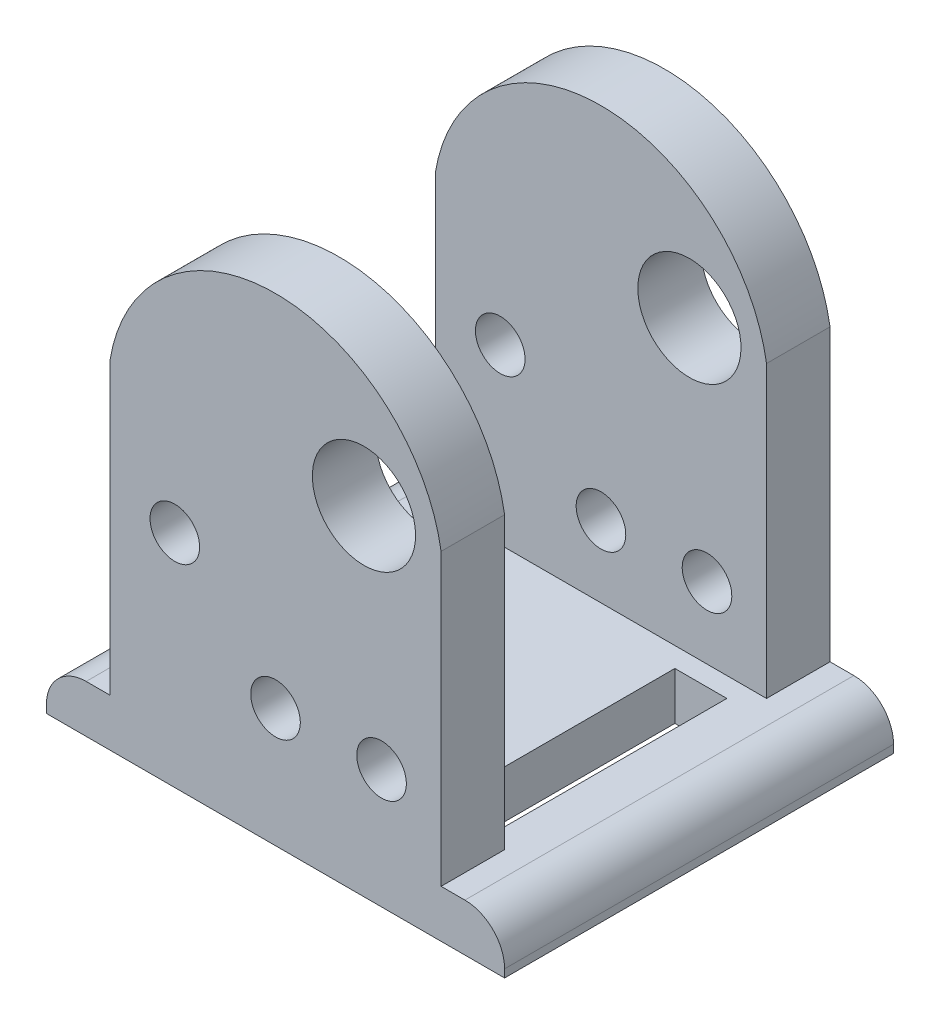
ISO-10303-21;
HEADER;
FILE_DESCRIPTION(('STEP AP214'),'2;1');
FILE_NAME('part.step','',(''),(''),'','','');
FILE_SCHEMA(('AUTOMOTIVE_DESIGN { 1 0 10303 214 1 1 1 1 }'));
ENDSEC;
DATA;
#1=APPLICATION_CONTEXT('core data for automotive mechanical design processes');
#2=APPLICATION_PROTOCOL_DEFINITION('international standard','automotive_design',2000,#1);
#3=PRODUCT_CONTEXT('',#1,'mechanical');
#4=PRODUCT('Part','Part','',(#3));
#5=PRODUCT_RELATED_PRODUCT_CATEGORY('part','',(#4));
#6=PRODUCT_DEFINITION_FORMATION('','',#4);
#7=PRODUCT_DEFINITION_CONTEXT('part definition',#1,'design');
#8=PRODUCT_DEFINITION('design','',#6,#7);
#9=PRODUCT_DEFINITION_SHAPE('','',#8);
#10=(LENGTH_UNIT() NAMED_UNIT(*) SI_UNIT(.MILLI.,.METRE.));
#11=(NAMED_UNIT(*) PLANE_ANGLE_UNIT() SI_UNIT($,.RADIAN.));
#12=(NAMED_UNIT(*) SI_UNIT($,.STERADIAN.) SOLID_ANGLE_UNIT());
#13=UNCERTAINTY_MEASURE_WITH_UNIT(LENGTH_MEASURE(1.E-05),#10,'distance_accuracy_value','');
#14=(GEOMETRIC_REPRESENTATION_CONTEXT(3) GLOBAL_UNCERTAINTY_ASSIGNED_CONTEXT((#13)) GLOBAL_UNIT_ASSIGNED_CONTEXT((#10,
#11,#12)) REPRESENTATION_CONTEXT('',''));
#15=CARTESIAN_POINT('',(0.,0.,0.));
#16=DIRECTION('',(0.,0.,1.));
#17=DIRECTION('',(1.,0.,0.));
#18=AXIS2_PLACEMENT_3D('',#15,#16,#17);
#19=CARTESIAN_POINT('',(4.59650450674411,-18.6219679292611,24.892));
#20=DIRECTION('',(-1.,0.,0.));
#21=DIRECTION('',(0.,0.,1.));
#22=AXIS2_PLACEMENT_3D('',#19,#20,#21);
#23=PLANE('',#22);
#24=DIRECTION('',(0.,0.,-1.));
#25=VECTOR('',#24,1.);
#26=CARTESIAN_POINT('',(4.59650450674411,-18.6219679292611,24.892));
#27=LINE('',#26,#25);
#28=CARTESIAN_POINT('',(4.59650450674411,-18.6219679292611,24.892));
#29=VERTEX_POINT('',#28);
#30=CARTESIAN_POINT('',(4.59650450674411,-18.6219679292611,20.828));
#31=VERTEX_POINT('',#30);
#32=EDGE_CURVE('E357',#29,#31,#27,.T.);
#33=ORIENTED_EDGE('',*,*,#32,.T.);
#34=DIRECTION('',(0.,1.,0.));
#35=VECTOR('',#34,1.);
#36=CARTESIAN_POINT('',(4.59650450674411,-18.6219679292611,20.828));
#37=LINE('',#36,#35);
#38=CARTESIAN_POINT('',(4.59650450674411,-0.0559847681622485,20.828));
#39=VERTEX_POINT('',#38);
#40=EDGE_CURVE('E275',#31,#39,#37,.T.);
#41=ORIENTED_EDGE('',*,*,#40,.T.);
#42=DIRECTION('',(0.,0.,-1.));
#43=VECTOR('',#42,1.);
#44=CARTESIAN_POINT('',(4.59650450674411,-0.0559847681622485,24.892));
#45=LINE('',#44,#43);
#46=CARTESIAN_POINT('',(4.59650450674411,-0.0559847681622485,24.892));
#47=VERTEX_POINT('',#46);
#48=EDGE_CURVE('E353',#47,#39,#45,.T.);
#49=ORIENTED_EDGE('',*,*,#48,.F.);
#50=DIRECTION('',(0.,1.,0.));
#51=VECTOR('',#50,1.);
#52=CARTESIAN_POINT('',(4.59650450674411,-18.6219679292611,24.892));
#53=LINE('',#52,#51);
#54=EDGE_CURVE('E308',#29,#47,#53,.T.);
#55=ORIENTED_EDGE('',*,*,#54,.F.);
#56=EDGE_LOOP('',(#33,#41,#49,#55));
#57=FACE_BOUND('',#56,.T.);
#58=ADVANCED_FACE('F34',(#57),#23,.F.);
#59=CARTESIAN_POINT('',(-5.9994954932559,-1.79349676816229,24.892));
#60=DIRECTION('',(0.,0.,-1.));
#61=DIRECTION('',(-1.,0.,0.));
#62=AXIS2_PLACEMENT_3D('',#59,#60,#61);
#63=CYLINDRICAL_SURFACE('',#62,10.737512);
#64=ORIENTED_EDGE('',*,*,#48,.T.);
#65=CARTESIAN_POINT('',(-5.9994954932559,-1.79349676816229,20.828));
#66=DIRECTION('',(0.,0.,1.));
#67=DIRECTION('',(1.,0.,0.));
#68=AXIS2_PLACEMENT_3D('',#65,#66,#67);
#69=CIRCLE('',#68,10.737512);
#70=CARTESIAN_POINT('',(-16.5954954932559,-0.0559847681622476,20.828));
#71=VERTEX_POINT('',#70);
#72=EDGE_CURVE('E272',#39,#71,#69,.T.);
#73=ORIENTED_EDGE('',*,*,#72,.T.);
#74=DIRECTION('',(0.,0.,-1.));
#75=VECTOR('',#74,1.);
#76=CARTESIAN_POINT('',(-16.5954954932559,-0.0559847681622471,24.892));
#77=LINE('',#76,#75);
#78=CARTESIAN_POINT('',(-16.5954954932559,-0.0559847681622471,24.892));
#79=VERTEX_POINT('',#78);
#80=EDGE_CURVE('E349',#79,#71,#77,.T.);
#81=ORIENTED_EDGE('',*,*,#80,.F.);
#82=CARTESIAN_POINT('',(-5.9994954932559,-1.79349676816229,24.892));
#83=DIRECTION('',(0.,0.,1.));
#84=DIRECTION('',(-1.,0.,0.));
#85=AXIS2_PLACEMENT_3D('',#82,#83,#84);
#86=CIRCLE('',#85,10.737512);
#87=EDGE_CURVE('E310',#47,#79,#86,.T.);
#88=ORIENTED_EDGE('',*,*,#87,.F.);
#89=EDGE_LOOP('',(#64,#73,#81,#88));
#90=FACE_BOUND('',#89,.T.);
#91=ADVANCED_FACE('F437',(#90),#63,.T.);
#92=CARTESIAN_POINT('',(-16.5954954932559,-18.6219679292611,24.892));
#93=DIRECTION('',(1.,0.,0.));
#94=DIRECTION('',(0.,0.,-1.));
#95=AXIS2_PLACEMENT_3D('',#92,#93,#94);
#96=PLANE('',#95);
#97=ORIENTED_EDGE('',*,*,#80,.T.);
#98=DIRECTION('',(0.,1.,0.));
#99=VECTOR('',#98,1.);
#100=CARTESIAN_POINT('',(-16.5954954932559,-18.6219679292611,20.828));
#101=LINE('',#100,#99);
#102=CARTESIAN_POINT('',(-16.5954954932559,-18.6219679292611,20.828));
#103=VERTEX_POINT('',#102);
#104=EDGE_CURVE('E231',#103,#71,#101,.T.);
#105=ORIENTED_EDGE('',*,*,#104,.F.);
#106=DIRECTION('',(0.,0.,-1.));
#107=VECTOR('',#106,1.);
#108=CARTESIAN_POINT('',(-16.5954954932559,-18.6219679292611,24.892));
#109=LINE('',#108,#107);
#110=CARTESIAN_POINT('',(-16.5954954932559,-18.6219679292611,24.892));
#111=VERTEX_POINT('',#110);
#112=EDGE_CURVE('E345',#111,#103,#109,.T.);
#113=ORIENTED_EDGE('',*,*,#112,.F.);
#114=DIRECTION('',(0.,-1.,0.));
#115=VECTOR('',#114,1.);
#116=CARTESIAN_POINT('',(-16.5954954932559,-18.6219679292611,24.892));
#117=LINE('',#116,#115);
#118=EDGE_CURVE('E312',#79,#111,#117,.T.);
#119=ORIENTED_EDGE('',*,*,#118,.F.);
#120=EDGE_LOOP('',(#97,#105,#113,#119));
#121=FACE_BOUND('',#120,.T.);
#122=ADVANCED_FACE('F432',(#121),#96,.F.);
#123=CARTESIAN_POINT('',(-12.446,-7.54674313448501,24.892));
#124=DIRECTION('',(0.,0.,-1.));
#125=DIRECTION('',(-1.,0.,0.));
#126=AXIS2_PLACEMENT_3D('',#123,#124,#125);
#127=CYLINDRICAL_SURFACE('',#126,1.5875);
#128=CARTESIAN_POINT('',(-12.446,-7.54674313448501,20.828));
#129=DIRECTION('',(0.,0.,1.));
#130=DIRECTION('',(1.,0.,0.));
#131=AXIS2_PLACEMENT_3D('',#128,#129,#130);
#132=CIRCLE('',#131,1.5875);
#133=CARTESIAN_POINT('',(-10.8585,-7.54674313448501,20.828));
#134=VERTEX_POINT('',#133);
#135=EDGE_CURVE('E269',#134,#134,#132,.T.);
#136=ORIENTED_EDGE('',*,*,#135,.F.);
#137=EDGE_LOOP('',(#136));
#138=FACE_BOUND('',#137,.T.);
#139=CARTESIAN_POINT('',(-12.446,-7.54674313448501,24.892));
#140=DIRECTION('',(0.,0.,1.));
#141=DIRECTION('',(1.,0.,0.));
#142=AXIS2_PLACEMENT_3D('',#139,#140,#141);
#143=CIRCLE('',#142,1.5875);
#144=CARTESIAN_POINT('',(-10.8585,-7.54674313448501,24.892));
#145=VERTEX_POINT('',#144);
#146=EDGE_CURVE('E297',#145,#145,#143,.T.);
#147=ORIENTED_EDGE('',*,*,#146,.T.);
#148=EDGE_LOOP('',(#147));
#149=FACE_BOUND('',#148,.T.);
#150=ADVANCED_FACE('F490',(#138,#149),#127,.F.);
#151=CARTESIAN_POINT('',(-0.3394954932559,0.,24.892));
#152=DIRECTION('',(0.,0.,-1.));
#153=DIRECTION('',(-1.,0.,0.));
#154=AXIS2_PLACEMENT_3D('',#151,#152,#153);
#155=CYLINDRICAL_SURFACE('',#154,3.302);
#156=CARTESIAN_POINT('',(-0.3394954932559,0.,20.828));
#157=DIRECTION('',(0.,0.,1.));
#158=DIRECTION('',(1.,0.,0.));
#159=AXIS2_PLACEMENT_3D('',#156,#157,#158);
#160=CIRCLE('',#159,3.302);
#161=CARTESIAN_POINT('',(2.9625045067441,0.,20.828));
#162=VERTEX_POINT('',#161);
#163=EDGE_CURVE('E266',#162,#162,#160,.T.);
#164=ORIENTED_EDGE('',*,*,#163,.F.);
#165=EDGE_LOOP('',(#164));
#166=FACE_BOUND('',#165,.T.);
#167=CARTESIAN_POINT('',(-0.3394954932559,0.,24.892));
#168=DIRECTION('',(0.,0.,1.));
#169=DIRECTION('',(1.,0.,0.));
#170=AXIS2_PLACEMENT_3D('',#167,#168,#169);
#171=CIRCLE('',#170,3.302);
#172=CARTESIAN_POINT('',(2.9625045067441,0.,24.892));
#173=VERTEX_POINT('',#172);
#174=EDGE_CURVE('E291',#173,#173,#171,.T.);
#175=ORIENTED_EDGE('',*,*,#174,.T.);
#176=EDGE_LOOP('',(#175));
#177=FACE_BOUND('',#176,.T.);
#178=ADVANCED_FACE('F494',(#166,#177),#155,.F.);
#179=CARTESIAN_POINT('',(-5.9994954932559,-14.0499679292611,24.892));
#180=DIRECTION('',(0.,0.,-1.));
#181=DIRECTION('',(-1.,0.,0.));
#182=AXIS2_PLACEMENT_3D('',#179,#180,#181);
#183=CYLINDRICAL_SURFACE('',#182,1.5875);
#184=CARTESIAN_POINT('',(-5.9994954932559,-14.0499679292611,20.828));
#185=DIRECTION('',(0.,0.,1.));
#186=DIRECTION('',(1.,0.,0.));
#187=AXIS2_PLACEMENT_3D('',#184,#185,#186);
#188=CIRCLE('',#187,1.5875);
#189=CARTESIAN_POINT('',(-4.41199549325589,-14.0499679292611,20.828));
#190=VERTEX_POINT('',#189);
#191=EDGE_CURVE('E263',#190,#190,#188,.T.);
#192=ORIENTED_EDGE('',*,*,#191,.F.);
#193=EDGE_LOOP('',(#192));
#194=FACE_BOUND('',#193,.T.);
#195=CARTESIAN_POINT('',(-5.9994954932559,-14.0499679292611,24.892));
#196=DIRECTION('',(0.,0.,1.));
#197=DIRECTION('',(1.,0.,0.));
#198=AXIS2_PLACEMENT_3D('',#195,#196,#197);
#199=CIRCLE('',#198,1.5875);
#200=CARTESIAN_POINT('',(-4.41199549325589,-14.0499679292611,24.892));
#201=VERTEX_POINT('',#200);
#202=EDGE_CURVE('E285',#201,#201,#199,.T.);
#203=ORIENTED_EDGE('',*,*,#202,.T.);
#204=EDGE_LOOP('',(#203));
#205=FACE_BOUND('',#204,.T.);
#206=ADVANCED_FACE('F501',(#194,#205),#183,.F.);
#207=CARTESIAN_POINT('',(0.786504506744107,-14.0499679292611,24.892));
#208=DIRECTION('',(0.,0.,-1.));
#209=DIRECTION('',(-1.,0.,0.));
#210=AXIS2_PLACEMENT_3D('',#207,#208,#209);
#211=CYLINDRICAL_SURFACE('',#210,1.5875);
#212=CARTESIAN_POINT('',(0.786504506744107,-14.0499679292611,20.828));
#213=DIRECTION('',(0.,0.,1.));
#214=DIRECTION('',(1.,0.,0.));
#215=AXIS2_PLACEMENT_3D('',#212,#213,#214);
#216=CIRCLE('',#215,1.5875);
#217=CARTESIAN_POINT('',(2.37400450674411,-14.0499679292611,20.828));
#218=VERTEX_POINT('',#217);
#219=EDGE_CURVE('E262',#218,#218,#216,.T.);
#220=ORIENTED_EDGE('',*,*,#219,.F.);
#221=EDGE_LOOP('',(#220));
#222=FACE_BOUND('',#221,.T.);
#223=CARTESIAN_POINT('',(0.786504506744107,-14.0499679292611,24.892));
#224=DIRECTION('',(0.,0.,1.));
#225=DIRECTION('',(1.,0.,0.));
#226=AXIS2_PLACEMENT_3D('',#223,#224,#225);
#227=CIRCLE('',#226,1.5875);
#228=CARTESIAN_POINT('',(2.37400450674411,-14.0499679292611,24.892));
#229=VERTEX_POINT('',#228);
#230=EDGE_CURVE('E279',#229,#229,#227,.T.);
#231=ORIENTED_EDGE('',*,*,#230,.T.);
#232=EDGE_LOOP('',(#231));
#233=FACE_BOUND('',#232,.T.);
#234=ADVANCED_FACE('F454',(#222,#233),#211,.F.);
#235=CARTESIAN_POINT('',(-5.9994954932559,-1.79349676816229,24.892));
#236=DIRECTION('',(0.,0.,-1.));
#237=DIRECTION('',(-1.,0.,0.));
#238=AXIS2_PLACEMENT_3D('',#235,#236,#237);
#239=PLANE('',#238);
#240=DIRECTION('',(0.,1.,0.));
#241=VECTOR('',#240,1.);
#242=CARTESIAN_POINT('',(8.6605045067441,-21.6699679292611,24.892));
#243=LINE('',#242,#241);
#244=CARTESIAN_POINT('',(8.6605045067441,-21.6699679292611,24.892));
#245=VERTEX_POINT('',#244);
#246=CARTESIAN_POINT('',(8.6605045067441,-21.1619679292611,24.892));
#247=VERTEX_POINT('',#246);
#248=EDGE_CURVE('E303',#245,#247,#243,.T.);
#249=ORIENTED_EDGE('',*,*,#248,.T.);
#250=CARTESIAN_POINT('',(6.1205045067441,-21.1619679292611,24.892));
#251=DIRECTION('',(0.,0.,-1.));
#252=DIRECTION('',(-1.,0.,0.));
#253=AXIS2_PLACEMENT_3D('',#250,#251,#252);
#254=CIRCLE('',#253,2.54);
#255=CARTESIAN_POINT('',(6.1205045067441,-18.6219679292611,24.892));
#256=VERTEX_POINT('',#255);
#257=EDGE_CURVE('E42',#247,#256,#254,.F.);
#258=ORIENTED_EDGE('',*,*,#257,.T.);
#259=DIRECTION('',(-1.,0.,0.));
#260=VECTOR('',#259,1.);
#261=CARTESIAN_POINT('',(8.6605045067441,-18.6219679292611,24.892));
#262=LINE('',#261,#260);
#263=EDGE_CURVE('E305',#256,#29,#262,.T.);
#264=ORIENTED_EDGE('',*,*,#263,.T.);
#265=ORIENTED_EDGE('',*,*,#54,.T.);
#266=ORIENTED_EDGE('',*,*,#87,.T.);
#267=ORIENTED_EDGE('',*,*,#118,.T.);
#268=DIRECTION('',(-1.,0.,0.));
#269=VECTOR('',#268,1.);
#270=CARTESIAN_POINT('',(-20.6594954932559,-18.6219679292611,24.892));
#271=LINE('',#270,#269);
#272=CARTESIAN_POINT('',(-18.1194954932559,-18.6219679292611,24.892));
#273=VERTEX_POINT('',#272);
#274=EDGE_CURVE('E314',#111,#273,#271,.T.);
#275=ORIENTED_EDGE('',*,*,#274,.T.);
#276=CARTESIAN_POINT('',(-18.1194954932559,-21.1619679292611,24.892));
#277=DIRECTION('',(0.,0.,-1.));
#278=DIRECTION('',(-1.,0.,0.));
#279=AXIS2_PLACEMENT_3D('',#276,#277,#278);
#280=CIRCLE('',#279,2.54);
#281=CARTESIAN_POINT('',(-20.6594954932559,-21.1619679292611,24.892));
#282=VERTEX_POINT('',#281);
#283=EDGE_CURVE('E49',#273,#282,#280,.F.);
#284=ORIENTED_EDGE('',*,*,#283,.T.);
#285=DIRECTION('',(0.,-1.,0.));
#286=VECTOR('',#285,1.);
#287=CARTESIAN_POINT('',(-20.6594954932559,-21.6699679292611,24.892));
#288=LINE('',#287,#286);
#289=CARTESIAN_POINT('',(-20.6594954932559,-21.6699679292611,24.892));
#290=VERTEX_POINT('',#289);
#291=EDGE_CURVE('E316',#282,#290,#288,.T.);
#292=ORIENTED_EDGE('',*,*,#291,.T.);
#293=DIRECTION('',(1.,0.,0.));
#294=VECTOR('',#293,1.);
#295=CARTESIAN_POINT('',(8.6605045067441,-21.6699679292611,24.892));
#296=LINE('',#295,#294);
#297=EDGE_CURVE('E318',#290,#245,#296,.T.);
#298=ORIENTED_EDGE('',*,*,#297,.T.);
#299=EDGE_LOOP('',(#249,#258,#264,#265,#266,#267,#275,#284,#292,#298));
#300=FACE_BOUND('',#299,.T.);
#301=ORIENTED_EDGE('',*,*,#146,.F.);
#302=EDGE_LOOP('',(#301));
#303=FACE_BOUND('',#302,.T.);
#304=ORIENTED_EDGE('',*,*,#174,.F.);
#305=EDGE_LOOP('',(#304));
#306=FACE_BOUND('',#305,.T.);
#307=ORIENTED_EDGE('',*,*,#202,.F.);
#308=EDGE_LOOP('',(#307));
#309=FACE_BOUND('',#308,.T.);
#310=ORIENTED_EDGE('',*,*,#230,.F.);
#311=EDGE_LOOP('',(#310));
#312=FACE_BOUND('',#311,.T.);
#313=ADVANCED_FACE('F396',(#300,#303,#306,#309,#312),#239,.F.);
#314=CARTESIAN_POINT('',(-5.9994954932559,-1.79349676816229,0.));
#315=DIRECTION('',(0.,0.,-1.));
#316=DIRECTION('',(-1.,0.,0.));
#317=AXIS2_PLACEMENT_3D('',#314,#315,#316);
#318=PLANE('',#317);
#319=CARTESIAN_POINT('',(-5.9994954932559,-14.0499679292611,0.));
#320=DIRECTION('',(0.,0.,1.));
#321=DIRECTION('',(1.,0.,0.));
#322=AXIS2_PLACEMENT_3D('',#319,#320,#321);
#323=CIRCLE('',#322,1.5875);
#324=CARTESIAN_POINT('',(-4.41199549325589,-14.0499679292611,0.));
#325=VERTEX_POINT('',#324);
#326=EDGE_CURVE('E282',#325,#325,#323,.T.);
#327=ORIENTED_EDGE('',*,*,#326,.T.);
#328=EDGE_LOOP('',(#327));
#329=FACE_BOUND('',#328,.T.);
#330=CARTESIAN_POINT('',(-12.446,-7.54674313448501,0.));
#331=DIRECTION('',(0.,0.,1.));
#332=DIRECTION('',(1.,0.,0.));
#333=AXIS2_PLACEMENT_3D('',#330,#331,#332);
#334=CIRCLE('',#333,1.5875);
#335=CARTESIAN_POINT('',(-10.8585,-7.54674313448501,0.));
#336=VERTEX_POINT('',#335);
#337=EDGE_CURVE('E294',#336,#336,#334,.T.);
#338=ORIENTED_EDGE('',*,*,#337,.T.);
#339=EDGE_LOOP('',(#338));
#340=FACE_BOUND('',#339,.T.);
#341=DIRECTION('',(-1.,0.,0.));
#342=VECTOR('',#341,1.);
#343=CARTESIAN_POINT('',(8.6605045067441,-18.6219679292611,0.));
#344=LINE('',#343,#342);
#345=CARTESIAN_POINT('',(6.1205045067441,-18.6219679292611,0.));
#346=VERTEX_POINT('',#345);
#347=CARTESIAN_POINT('',(4.59650450674411,-18.6219679292611,0.));
#348=VERTEX_POINT('',#347);
#349=EDGE_CURVE('E322',#346,#348,#344,.T.);
#350=ORIENTED_EDGE('',*,*,#349,.F.);
#351=CARTESIAN_POINT('',(6.1205045067441,-21.1619679292611,0.));
#352=DIRECTION('',(0.,0.,-1.));
#353=DIRECTION('',(-1.,0.,0.));
#354=AXIS2_PLACEMENT_3D('',#351,#352,#353);
#355=CIRCLE('',#354,2.54);
#356=CARTESIAN_POINT('',(8.6605045067441,-21.1619679292611,0.));
#357=VERTEX_POINT('',#356);
#358=EDGE_CURVE('E391',#346,#357,#355,.T.);
#359=ORIENTED_EDGE('',*,*,#358,.T.);
#360=DIRECTION('',(0.,1.,0.));
#361=VECTOR('',#360,1.);
#362=CARTESIAN_POINT('',(8.6605045067441,-21.6699679292611,0.));
#363=LINE('',#362,#361);
#364=CARTESIAN_POINT('',(8.6605045067441,-21.6699679292611,0.));
#365=VERTEX_POINT('',#364);
#366=EDGE_CURVE('E300',#365,#357,#363,.T.);
#367=ORIENTED_EDGE('',*,*,#366,.F.);
#368=DIRECTION('',(1.,0.,0.));
#369=VECTOR('',#368,1.);
#370=CARTESIAN_POINT('',(8.6605045067441,-21.6699679292611,0.));
#371=LINE('',#370,#369);
#372=CARTESIAN_POINT('',(-20.6594954932559,-21.6699679292611,0.));
#373=VERTEX_POINT('',#372);
#374=EDGE_CURVE('E306',#373,#365,#371,.T.);
#375=ORIENTED_EDGE('',*,*,#374,.F.);
#376=DIRECTION('',(0.,-1.,0.));
#377=VECTOR('',#376,1.);
#378=CARTESIAN_POINT('',(-20.6594954932559,-21.6699679292611,0.));
#379=LINE('',#378,#377);
#380=CARTESIAN_POINT('',(-20.6594954932559,-21.1619679292611,0.));
#381=VERTEX_POINT('',#380);
#382=EDGE_CURVE('E336',#381,#373,#379,.T.);
#383=ORIENTED_EDGE('',*,*,#382,.F.);
#384=CARTESIAN_POINT('',(-18.1194954932559,-21.1619679292611,0.));
#385=DIRECTION('',(0.,0.,-1.));
#386=DIRECTION('',(-1.,0.,0.));
#387=AXIS2_PLACEMENT_3D('',#384,#385,#386);
#388=CIRCLE('',#387,2.54);
#389=CARTESIAN_POINT('',(-18.1194954932559,-18.6219679292611,0.));
#390=VERTEX_POINT('',#389);
#391=EDGE_CURVE('E389',#381,#390,#388,.T.);
#392=ORIENTED_EDGE('',*,*,#391,.T.);
#393=DIRECTION('',(-1.,0.,0.));
#394=VECTOR('',#393,1.);
#395=CARTESIAN_POINT('',(-20.6594954932559,-18.6219679292611,0.));
#396=LINE('',#395,#394);
#397=CARTESIAN_POINT('',(-16.5954954932559,-18.6219679292611,0.));
#398=VERTEX_POINT('',#397);
#399=EDGE_CURVE('E333',#398,#390,#396,.T.);
#400=ORIENTED_EDGE('',*,*,#399,.F.);
#401=DIRECTION('',(0.,-1.,0.));
#402=VECTOR('',#401,1.);
#403=CARTESIAN_POINT('',(-16.5954954932559,-18.6219679292611,0.));
#404=LINE('',#403,#402);
#405=CARTESIAN_POINT('',(-16.5954954932559,-0.0559847681622471,0.));
#406=VERTEX_POINT('',#405);
#407=EDGE_CURVE('E330',#406,#398,#404,.T.);
#408=ORIENTED_EDGE('',*,*,#407,.F.);
#409=CARTESIAN_POINT('',(-5.9994954932559,-1.79349676816229,0.));
#410=DIRECTION('',(0.,0.,1.));
#411=DIRECTION('',(-1.,0.,0.));
#412=AXIS2_PLACEMENT_3D('',#409,#410,#411);
#413=CIRCLE('',#412,10.737512);
#414=CARTESIAN_POINT('',(4.59650450674411,-0.0559847681622485,0.));
#415=VERTEX_POINT('',#414);
#416=EDGE_CURVE('E327',#415,#406,#413,.T.);
#417=ORIENTED_EDGE('',*,*,#416,.F.);
#418=DIRECTION('',(0.,1.,0.));
#419=VECTOR('',#418,1.);
#420=CARTESIAN_POINT('',(4.59650450674411,-18.6219679292611,0.));
#421=LINE('',#420,#419);
#422=EDGE_CURVE('E324',#348,#415,#421,.T.);
#423=ORIENTED_EDGE('',*,*,#422,.F.);
#424=EDGE_LOOP('',(#350,#359,#367,#375,#383,#392,#400,#408,#417,#423));
#425=FACE_BOUND('',#424,.T.);
#426=CARTESIAN_POINT('',(-0.3394954932559,0.,0.));
#427=DIRECTION('',(0.,0.,1.));
#428=DIRECTION('',(1.,0.,0.));
#429=AXIS2_PLACEMENT_3D('',#426,#427,#428);
#430=CIRCLE('',#429,3.302);
#431=CARTESIAN_POINT('',(2.9625045067441,0.,0.));
#432=VERTEX_POINT('',#431);
#433=EDGE_CURVE('E288',#432,#432,#430,.T.);
#434=ORIENTED_EDGE('',*,*,#433,.T.);
#435=EDGE_LOOP('',(#434));
#436=FACE_BOUND('',#435,.T.);
#437=CARTESIAN_POINT('',(0.786504506744107,-14.0499679292611,0.));
#438=DIRECTION('',(0.,0.,1.));
#439=DIRECTION('',(1.,0.,0.));
#440=AXIS2_PLACEMENT_3D('',#437,#438,#439);
#441=CIRCLE('',#440,1.5875);
#442=CARTESIAN_POINT('',(2.37400450674411,-14.0499679292611,0.));
#443=VERTEX_POINT('',#442);
#444=EDGE_CURVE('E278',#443,#443,#441,.T.);
#445=ORIENTED_EDGE('',*,*,#444,.T.);
#446=EDGE_LOOP('',(#445));
#447=FACE_BOUND('',#446,.T.);
#448=ADVANCED_FACE('F408',(#329,#340,#425,#436,#447),#318,.T.);
#449=CARTESIAN_POINT('',(8.6605045067441,-21.6699679292611,24.892));
#450=DIRECTION('',(-1.,0.,0.));
#451=DIRECTION('',(0.,0.,1.));
#452=AXIS2_PLACEMENT_3D('',#449,#450,#451);
#453=PLANE('',#452);
#454=ORIENTED_EDGE('',*,*,#366,.T.);
#455=DIRECTION('',(0.,0.,-1.));
#456=VECTOR('',#455,1.);
#457=CARTESIAN_POINT('',(8.6605045067441,-21.1619679292611,24.892));
#458=LINE('',#457,#456);
#459=EDGE_CURVE('E57',#357,#247,#458,.F.);
#460=ORIENTED_EDGE('',*,*,#459,.T.);
#461=ORIENTED_EDGE('',*,*,#248,.F.);
#462=DIRECTION('',(0.,0.,-1.));
#463=VECTOR('',#462,1.);
#464=CARTESIAN_POINT('',(8.6605045067441,-21.6699679292611,24.892));
#465=LINE('',#464,#463);
#466=EDGE_CURVE('E320',#245,#365,#465,.T.);
#467=ORIENTED_EDGE('',*,*,#466,.T.);
#468=EDGE_LOOP('',(#454,#460,#461,#467));
#469=FACE_BOUND('',#468,.T.);
#470=ADVANCED_FACE('F412',(#469),#453,.F.);
#471=CARTESIAN_POINT('',(4.59650450674411,-0.0559847681622485,4.064));
#472=VERTEX_POINT('',#471);
#473=EDGE_CURVE('E352',#472,#415,#45,.T.);
#474=ORIENTED_EDGE('',*,*,#473,.F.);
#475=DIRECTION('',(0.,-1.,0.));
#476=VECTOR('',#475,1.);
#477=CARTESIAN_POINT('',(4.59650450674411,-18.6219679292611,4.064));
#478=LINE('',#477,#476);
#479=CARTESIAN_POINT('',(4.59650450674411,-18.6219679292611,4.064));
#480=VERTEX_POINT('',#479);
#481=EDGE_CURVE('E259',#472,#480,#478,.T.);
#482=ORIENTED_EDGE('',*,*,#481,.T.);
#483=EDGE_CURVE('E356',#480,#348,#27,.T.);
#484=ORIENTED_EDGE('',*,*,#483,.T.);
#485=ORIENTED_EDGE('',*,*,#422,.T.);
#486=EDGE_LOOP('',(#474,#482,#484,#485));
#487=FACE_BOUND('',#486,.T.);
#488=ADVANCED_FACE('F458',(#487),#23,.F.);
#489=CARTESIAN_POINT('',(-16.5954954932559,-0.0559847681622476,4.064));
#490=VERTEX_POINT('',#489);
#491=EDGE_CURVE('E348',#490,#406,#77,.T.);
#492=ORIENTED_EDGE('',*,*,#491,.F.);
#493=CARTESIAN_POINT('',(-5.9994954932559,-1.79349676816229,4.064));
#494=DIRECTION('',(0.,0.,-1.));
#495=DIRECTION('',(0.,1.,0.));
#496=AXIS2_PLACEMENT_3D('',#493,#494,#495);
#497=CIRCLE('',#496,10.737512);
#498=EDGE_CURVE('E256',#490,#472,#497,.T.);
#499=ORIENTED_EDGE('',*,*,#498,.T.);
#500=ORIENTED_EDGE('',*,*,#473,.T.);
#501=ORIENTED_EDGE('',*,*,#416,.T.);
#502=EDGE_LOOP('',(#492,#499,#500,#501));
#503=FACE_BOUND('',#502,.T.);
#504=ADVANCED_FACE('F463',(#503),#63,.T.);
#505=CARTESIAN_POINT('',(-16.5954954932559,-18.6219679292611,4.064));
#506=VERTEX_POINT('',#505);
#507=EDGE_CURVE('E344',#506,#398,#109,.T.);
#508=ORIENTED_EDGE('',*,*,#507,.F.);
#509=DIRECTION('',(0.,-1.,0.));
#510=VECTOR('',#509,1.);
#511=CARTESIAN_POINT('',(-16.5954954932559,-0.0559847681622471,4.064));
#512=LINE('',#511,#510);
#513=EDGE_CURVE('E239',#490,#506,#512,.T.);
#514=ORIENTED_EDGE('',*,*,#513,.F.);
#515=ORIENTED_EDGE('',*,*,#491,.T.);
#516=ORIENTED_EDGE('',*,*,#407,.T.);
#517=EDGE_LOOP('',(#508,#514,#515,#516));
#518=FACE_BOUND('',#517,.T.);
#519=ADVANCED_FACE('F471',(#518),#96,.F.);
#520=CARTESIAN_POINT('',(-20.6594954932559,-18.6219679292611,24.892));
#521=DIRECTION('',(0.,-1.,0.));
#522=DIRECTION('',(0.,0.,-1.));
#523=AXIS2_PLACEMENT_3D('',#520,#521,#522);
#524=PLANE('',#523);
#525=DIRECTION('',(0.,0.,-1.));
#526=VECTOR('',#525,1.);
#527=CARTESIAN_POINT('',(-15.3254954932559,-18.6219679292611,19.558));
#528=LINE('',#527,#526);
#529=CARTESIAN_POINT('',(-15.3254954932559,-18.6219679292611,19.558));
#530=VERTEX_POINT('',#529);
#531=CARTESIAN_POINT('',(-15.3254954932559,-18.6219679292611,5.334));
#532=VERTEX_POINT('',#531);
#533=EDGE_CURVE('E212',#530,#532,#528,.T.);
#534=ORIENTED_EDGE('',*,*,#533,.T.);
#535=DIRECTION('',(-1.,0.,0.));
#536=VECTOR('',#535,1.);
#537=CARTESIAN_POINT('',(-11.5154954932559,-18.6219679292611,5.334));
#538=LINE('',#537,#536);
#539=CARTESIAN_POINT('',(-11.5154954932559,-18.6219679292611,5.334));
#540=VERTEX_POINT('',#539);
#541=EDGE_CURVE('E190',#540,#532,#538,.T.);
#542=ORIENTED_EDGE('',*,*,#541,.F.);
#543=DIRECTION('',(0.,0.,1.));
#544=VECTOR('',#543,1.);
#545=CARTESIAN_POINT('',(-11.5154954932559,-18.6219679292611,5.334));
#546=LINE('',#545,#544);
#547=CARTESIAN_POINT('',(-11.5154954932559,-18.6219679292611,19.558));
#548=VERTEX_POINT('',#547);
#549=EDGE_CURVE('E199',#540,#548,#546,.T.);
#550=ORIENTED_EDGE('',*,*,#549,.T.);
#551=DIRECTION('',(-1.,0.,0.));
#552=VECTOR('',#551,1.);
#553=CARTESIAN_POINT('',(-11.5154954932559,-18.6219679292611,19.558));
#554=LINE('',#553,#552);
#555=EDGE_CURVE('E205',#548,#530,#554,.T.);
#556=ORIENTED_EDGE('',*,*,#555,.T.);
#557=EDGE_LOOP('',(#534,#542,#550,#556));
#558=FACE_BOUND('',#557,.T.);
#559=DIRECTION('',(0.,0.,1.));
#560=VECTOR('',#559,1.);
#561=CARTESIAN_POINT('',(0.,-18.6219679292611,0.));
#562=LINE('',#561,#560);
#563=CARTESIAN_POINT('',(0.,-18.6219679292611,5.334));
#564=VERTEX_POINT('',#563);
#565=CARTESIAN_POINT('',(0.,-18.6219679292611,19.558));
#566=VERTEX_POINT('',#565);
#567=EDGE_CURVE('E215',#564,#566,#562,.T.);
#568=ORIENTED_EDGE('',*,*,#567,.F.);
#569=DIRECTION('',(-1.,0.,0.));
#570=VECTOR('',#569,1.);
#571=CARTESIAN_POINT('',(0.,-18.6219679292611,5.334));
#572=LINE('',#571,#570);
#573=CARTESIAN_POINT('',(3.32650450674411,-18.6219679292611,5.334));
#574=VERTEX_POINT('',#573);
#575=EDGE_CURVE('E213',#574,#564,#572,.T.);
#576=ORIENTED_EDGE('',*,*,#575,.F.);
#577=DIRECTION('',(0.,0.,-1.));
#578=VECTOR('',#577,1.);
#579=CARTESIAN_POINT('',(3.32650450674411,-18.6219679292611,0.));
#580=LINE('',#579,#578);
#581=CARTESIAN_POINT('',(3.32650450674411,-18.6219679292611,19.558));
#582=VERTEX_POINT('',#581);
#583=EDGE_CURVE('E225',#582,#574,#580,.T.);
#584=ORIENTED_EDGE('',*,*,#583,.F.);
#585=DIRECTION('',(-1.,0.,0.));
#586=VECTOR('',#585,1.);
#587=CARTESIAN_POINT('',(0.,-18.6219679292611,19.558));
#588=LINE('',#587,#586);
#589=EDGE_CURVE('E222',#582,#566,#588,.T.);
#590=ORIENTED_EDGE('',*,*,#589,.T.);
#591=EDGE_LOOP('',(#568,#576,#584,#590));
#592=FACE_BOUND('',#591,.T.);
#593=ORIENTED_EDGE('',*,*,#263,.F.);
#594=DIRECTION('',(0.,0.,-1.));
#595=VECTOR('',#594,1.);
#596=CARTESIAN_POINT('',(6.1205045067441,-18.6219679292611,24.892));
#597=LINE('',#596,#595);
#598=EDGE_CURVE('E386',#256,#346,#597,.T.);
#599=ORIENTED_EDGE('',*,*,#598,.T.);
#600=ORIENTED_EDGE('',*,*,#349,.T.);
#601=ORIENTED_EDGE('',*,*,#483,.F.);
#602=DIRECTION('',(-1.,0.,0.));
#603=VECTOR('',#602,1.);
#604=CARTESIAN_POINT('',(5.24850450674411,-18.6219679292611,4.064));
#605=LINE('',#604,#603);
#606=EDGE_CURVE('E241',#480,#506,#605,.T.);
#607=ORIENTED_EDGE('',*,*,#606,.T.);
#608=ORIENTED_EDGE('',*,*,#507,.T.);
#609=ORIENTED_EDGE('',*,*,#399,.T.);
#610=DIRECTION('',(0.,0.,-1.));
#611=VECTOR('',#610,1.);
#612=CARTESIAN_POINT('',(-18.1194954932559,-18.6219679292611,24.892));
#613=LINE('',#612,#611);
#614=EDGE_CURVE('E384',#390,#273,#613,.F.);
#615=ORIENTED_EDGE('',*,*,#614,.T.);
#616=ORIENTED_EDGE('',*,*,#274,.F.);
#617=ORIENTED_EDGE('',*,*,#112,.T.);
#618=DIRECTION('',(-1.,0.,0.));
#619=VECTOR('',#618,1.);
#620=CARTESIAN_POINT('',(5.24850450674411,-18.6219679292611,20.828));
#621=LINE('',#620,#619);
#622=EDGE_CURVE('E244',#31,#103,#621,.T.);
#623=ORIENTED_EDGE('',*,*,#622,.F.);
#624=ORIENTED_EDGE('',*,*,#32,.F.);
#625=EDGE_LOOP('',(#593,#599,#600,#601,#607,#608,#609,#615,#616,#617,#623,#624));
#626=FACE_BOUND('',#625,.T.);
#627=ADVANCED_FACE('F209',(#558,#592,#626),#524,.F.);
#628=CARTESIAN_POINT('',(-20.6594954932559,-21.6699679292611,24.892));
#629=DIRECTION('',(1.,0.,0.));
#630=DIRECTION('',(0.,0.,-1.));
#631=AXIS2_PLACEMENT_3D('',#628,#629,#630);
#632=PLANE('',#631);
#633=ORIENTED_EDGE('',*,*,#291,.F.);
#634=DIRECTION('',(0.,0.,-1.));
#635=VECTOR('',#634,1.);
#636=CARTESIAN_POINT('',(-20.6594954932559,-21.1619679292611,24.892));
#637=LINE('',#636,#635);
#638=EDGE_CURVE('E11',#282,#381,#637,.T.);
#639=ORIENTED_EDGE('',*,*,#638,.T.);
#640=ORIENTED_EDGE('',*,*,#382,.T.);
#641=DIRECTION('',(0.,0.,-1.));
#642=VECTOR('',#641,1.);
#643=CARTESIAN_POINT('',(-20.6594954932559,-21.6699679292611,24.892));
#644=LINE('',#643,#642);
#645=EDGE_CURVE('E341',#290,#373,#644,.T.);
#646=ORIENTED_EDGE('',*,*,#645,.F.);
#647=EDGE_LOOP('',(#633,#639,#640,#646));
#648=FACE_BOUND('',#647,.T.);
#649=ADVANCED_FACE('F421',(#648),#632,.F.);
#650=CARTESIAN_POINT('',(8.6605045067441,-21.6699679292611,24.892));
#651=DIRECTION('',(0.,1.,0.));
#652=DIRECTION('',(0.,0.,1.));
#653=AXIS2_PLACEMENT_3D('',#650,#651,#652);
#654=PLANE('',#653);
#655=DIRECTION('',(0.,0.,1.));
#656=VECTOR('',#655,1.);
#657=CARTESIAN_POINT('',(-11.5154954932559,-21.6699679292611,24.892));
#658=LINE('',#657,#656);
#659=CARTESIAN_POINT('',(-11.5154954932559,-21.6699679292611,5.334));
#660=VERTEX_POINT('',#659);
#661=CARTESIAN_POINT('',(-11.5154954932559,-21.6699679292611,19.558));
#662=VERTEX_POINT('',#661);
#663=EDGE_CURVE('E381',#660,#662,#658,.T.);
#664=ORIENTED_EDGE('',*,*,#663,.F.);
#665=DIRECTION('',(-1.,0.,0.));
#666=VECTOR('',#665,1.);
#667=CARTESIAN_POINT('',(8.6605045067441,-21.6699679292611,5.334));
#668=LINE('',#667,#666);
#669=CARTESIAN_POINT('',(-15.3254954932559,-21.6699679292611,5.334));
#670=VERTEX_POINT('',#669);
#671=EDGE_CURVE('E193',#660,#670,#668,.T.);
#672=ORIENTED_EDGE('',*,*,#671,.T.);
#673=DIRECTION('',(0.,0.,-1.));
#674=VECTOR('',#673,1.);
#675=CARTESIAN_POINT('',(-15.3254954932559,-21.6699679292611,24.892));
#676=LINE('',#675,#674);
#677=CARTESIAN_POINT('',(-15.3254954932559,-21.6699679292611,19.558));
#678=VERTEX_POINT('',#677);
#679=EDGE_CURVE('E376',#678,#670,#676,.T.);
#680=ORIENTED_EDGE('',*,*,#679,.F.);
#681=DIRECTION('',(-1.,0.,0.));
#682=VECTOR('',#681,1.);
#683=CARTESIAN_POINT('',(8.6605045067441,-21.6699679292611,19.558));
#684=LINE('',#683,#682);
#685=EDGE_CURVE('E378',#662,#678,#684,.T.);
#686=ORIENTED_EDGE('',*,*,#685,.F.);
#687=EDGE_LOOP('',(#664,#672,#680,#686));
#688=FACE_BOUND('',#687,.T.);
#689=DIRECTION('',(0.,0.,-1.));
#690=VECTOR('',#689,1.);
#691=CARTESIAN_POINT('',(3.32650450674411,-21.6699679292611,24.892));
#692=LINE('',#691,#690);
#693=CARTESIAN_POINT('',(3.32650450674411,-21.6699679292611,19.558));
#694=VERTEX_POINT('',#693);
#695=CARTESIAN_POINT('',(3.32650450674411,-21.6699679292611,5.334));
#696=VERTEX_POINT('',#695);
#697=EDGE_CURVE('E370',#694,#696,#692,.T.);
#698=ORIENTED_EDGE('',*,*,#697,.T.);
#699=DIRECTION('',(-1.,0.,0.));
#700=VECTOR('',#699,1.);
#701=CARTESIAN_POINT('',(8.6605045067441,-21.6699679292611,5.334));
#702=LINE('',#701,#700);
#703=CARTESIAN_POINT('',(0.,-21.6699679292611,5.334));
#704=VERTEX_POINT('',#703);
#705=EDGE_CURVE('E373',#696,#704,#702,.T.);
#706=ORIENTED_EDGE('',*,*,#705,.T.);
#707=DIRECTION('',(0.,0.,1.));
#708=VECTOR('',#707,1.);
#709=CARTESIAN_POINT('',(0.,-21.6699679292611,24.892));
#710=LINE('',#709,#708);
#711=CARTESIAN_POINT('',(0.,-21.6699679292611,19.558));
#712=VERTEX_POINT('',#711);
#713=EDGE_CURVE('E360',#704,#712,#710,.T.);
#714=ORIENTED_EDGE('',*,*,#713,.T.);
#715=DIRECTION('',(-1.,0.,0.));
#716=VECTOR('',#715,1.);
#717=CARTESIAN_POINT('',(8.6605045067441,-21.6699679292611,19.558));
#718=LINE('',#717,#716);
#719=EDGE_CURVE('E367',#694,#712,#718,.T.);
#720=ORIENTED_EDGE('',*,*,#719,.F.);
#721=EDGE_LOOP('',(#698,#706,#714,#720));
#722=FACE_BOUND('',#721,.T.);
#723=ORIENTED_EDGE('',*,*,#374,.T.);
#724=ORIENTED_EDGE('',*,*,#466,.F.);
#725=ORIENTED_EDGE('',*,*,#297,.F.);
#726=ORIENTED_EDGE('',*,*,#645,.T.);
#727=EDGE_LOOP('',(#723,#724,#725,#726));
#728=FACE_BOUND('',#727,.T.);
#729=ADVANCED_FACE('F416',(#688,#722,#728),#654,.F.);
#730=CARTESIAN_POINT('',(-12.446,-7.54674313448501,4.064));
#731=DIRECTION('',(0.,0.,-1.));
#732=DIRECTION('',(0.,1.,0.));
#733=AXIS2_PLACEMENT_3D('',#730,#731,#732);
#734=CIRCLE('',#733,1.5875);
#735=CARTESIAN_POINT('',(-12.446,-5.95924313448501,4.064));
#736=VERTEX_POINT('',#735);
#737=EDGE_CURVE('E253',#736,#736,#734,.T.);
#738=ORIENTED_EDGE('',*,*,#737,.F.);
#739=EDGE_LOOP('',(#738));
#740=FACE_BOUND('',#739,.T.);
#741=ORIENTED_EDGE('',*,*,#337,.F.);
#742=EDGE_LOOP('',(#741));
#743=FACE_BOUND('',#742,.T.);
#744=ADVANCED_FACE('F497',(#740,#743),#127,.F.);
#745=CARTESIAN_POINT('',(-0.3394954932559,0.,4.064));
#746=DIRECTION('',(0.,0.,-1.));
#747=DIRECTION('',(0.,1.,0.));
#748=AXIS2_PLACEMENT_3D('',#745,#746,#747);
#749=CIRCLE('',#748,3.302);
#750=CARTESIAN_POINT('',(-0.3394954932559,3.302,4.064));
#751=VERTEX_POINT('',#750);
#752=EDGE_CURVE('E250',#751,#751,#749,.T.);
#753=ORIENTED_EDGE('',*,*,#752,.F.);
#754=EDGE_LOOP('',(#753));
#755=FACE_BOUND('',#754,.T.);
#756=ORIENTED_EDGE('',*,*,#433,.F.);
#757=EDGE_LOOP('',(#756));
#758=FACE_BOUND('',#757,.T.);
#759=ADVANCED_FACE('F504',(#755,#758),#155,.F.);
#760=CARTESIAN_POINT('',(-5.9994954932559,-14.0499679292611,4.064));
#761=DIRECTION('',(0.,0.,-1.));
#762=DIRECTION('',(0.,1.,0.));
#763=AXIS2_PLACEMENT_3D('',#760,#761,#762);
#764=CIRCLE('',#763,1.5875);
#765=CARTESIAN_POINT('',(-5.9994954932559,-12.4624679292611,4.064));
#766=VERTEX_POINT('',#765);
#767=EDGE_CURVE('E247',#766,#766,#764,.T.);
#768=ORIENTED_EDGE('',*,*,#767,.F.);
#769=EDGE_LOOP('',(#768));
#770=FACE_BOUND('',#769,.T.);
#771=ORIENTED_EDGE('',*,*,#326,.F.);
#772=EDGE_LOOP('',(#771));
#773=FACE_BOUND('',#772,.T.);
#774=ADVANCED_FACE('F451',(#770,#773),#183,.F.);
#775=CARTESIAN_POINT('',(0.786504506744107,-14.0499679292611,4.064));
#776=DIRECTION('',(0.,0.,-1.));
#777=DIRECTION('',(0.,1.,0.));
#778=AXIS2_PLACEMENT_3D('',#775,#776,#777);
#779=CIRCLE('',#778,1.5875);
#780=CARTESIAN_POINT('',(0.786504506744107,-12.4624679292611,4.064));
#781=VERTEX_POINT('',#780);
#782=EDGE_CURVE('E246',#781,#781,#779,.T.);
#783=ORIENTED_EDGE('',*,*,#782,.F.);
#784=EDGE_LOOP('',(#783));
#785=FACE_BOUND('',#784,.T.);
#786=ORIENTED_EDGE('',*,*,#444,.F.);
#787=EDGE_LOOP('',(#786));
#788=FACE_BOUND('',#787,.T.);
#789=ADVANCED_FACE('F441',(#785,#788),#211,.F.);
#790=CARTESIAN_POINT('',(5.24850450674411,-18.6219679292611,20.828));
#791=DIRECTION('',(0.,0.,1.));
#792=DIRECTION('',(1.,0.,0.));
#793=AXIS2_PLACEMENT_3D('',#790,#791,#792);
#794=PLANE('',#793);
#795=ORIENTED_EDGE('',*,*,#135,.T.);
#796=EDGE_LOOP('',(#795));
#797=FACE_BOUND('',#796,.T.);
#798=ORIENTED_EDGE('',*,*,#163,.T.);
#799=EDGE_LOOP('',(#798));
#800=FACE_BOUND('',#799,.T.);
#801=ORIENTED_EDGE('',*,*,#191,.T.);
#802=EDGE_LOOP('',(#801));
#803=FACE_BOUND('',#802,.T.);
#804=ORIENTED_EDGE('',*,*,#219,.T.);
#805=EDGE_LOOP('',(#804));
#806=FACE_BOUND('',#805,.T.);
#807=ORIENTED_EDGE('',*,*,#622,.T.);
#808=ORIENTED_EDGE('',*,*,#104,.T.);
#809=ORIENTED_EDGE('',*,*,#72,.F.);
#810=ORIENTED_EDGE('',*,*,#40,.F.);
#811=EDGE_LOOP('',(#807,#808,#809,#810));
#812=FACE_BOUND('',#811,.T.);
#813=ADVANCED_FACE('F438',(#797,#800,#803,#806,#812),#794,.F.);
#814=CARTESIAN_POINT('',(5.24850450674411,-0.0559847681622471,4.064));
#815=DIRECTION('',(0.,0.,-1.));
#816=DIRECTION('',(0.,1.,0.));
#817=AXIS2_PLACEMENT_3D('',#814,#815,#816);
#818=PLANE('',#817);
#819=ORIENTED_EDGE('',*,*,#737,.T.);
#820=EDGE_LOOP('',(#819));
#821=FACE_BOUND('',#820,.T.);
#822=ORIENTED_EDGE('',*,*,#752,.T.);
#823=EDGE_LOOP('',(#822));
#824=FACE_BOUND('',#823,.T.);
#825=ORIENTED_EDGE('',*,*,#767,.T.);
#826=EDGE_LOOP('',(#825));
#827=FACE_BOUND('',#826,.T.);
#828=ORIENTED_EDGE('',*,*,#782,.T.);
#829=EDGE_LOOP('',(#828));
#830=FACE_BOUND('',#829,.T.);
#831=ORIENTED_EDGE('',*,*,#498,.F.);
#832=ORIENTED_EDGE('',*,*,#513,.T.);
#833=ORIENTED_EDGE('',*,*,#606,.F.);
#834=ORIENTED_EDGE('',*,*,#481,.F.);
#835=EDGE_LOOP('',(#831,#832,#833,#834));
#836=FACE_BOUND('',#835,.T.);
#837=ADVANCED_FACE('F440',(#821,#824,#827,#830,#836),#818,.F.);
#838=CARTESIAN_POINT('',(0.,-40.4659679292611,5.334));
#839=DIRECTION('',(0.,0.,-1.));
#840=DIRECTION('',(-1.,0.,0.));
#841=AXIS2_PLACEMENT_3D('',#838,#839,#840);
#842=PLANE('',#841);
#843=DIRECTION('',(0.,1.,0.));
#844=VECTOR('',#843,1.);
#845=CARTESIAN_POINT('',(3.32650450674411,-40.4659679292611,5.334));
#846=LINE('',#845,#844);
#847=EDGE_CURVE('E229',#696,#574,#846,.T.);
#848=ORIENTED_EDGE('',*,*,#847,.T.);
#849=ORIENTED_EDGE('',*,*,#575,.T.);
#850=DIRECTION('',(0.,1.,0.));
#851=VECTOR('',#850,1.);
#852=CARTESIAN_POINT('',(0.,-40.4659679292611,5.334));
#853=LINE('',#852,#851);
#854=EDGE_CURVE('E228',#704,#564,#853,.T.);
#855=ORIENTED_EDGE('',*,*,#854,.F.);
#856=ORIENTED_EDGE('',*,*,#705,.F.);
#857=EDGE_LOOP('',(#848,#849,#855,#856));
#858=FACE_BOUND('',#857,.T.);
#859=ADVANCED_FACE('F448',(#858),#842,.F.);
#860=CARTESIAN_POINT('',(3.32650450674411,-40.4659679292611,0.));
#861=DIRECTION('',(1.,0.,0.));
#862=DIRECTION('',(0.,0.,-1.));
#863=AXIS2_PLACEMENT_3D('',#860,#861,#862);
#864=PLANE('',#863);
#865=DIRECTION('',(0.,1.,0.));
#866=VECTOR('',#865,1.);
#867=CARTESIAN_POINT('',(3.32650450674411,-40.4659679292611,19.558));
#868=LINE('',#867,#866);
#869=EDGE_CURVE('E232',#694,#582,#868,.T.);
#870=ORIENTED_EDGE('',*,*,#869,.T.);
#871=ORIENTED_EDGE('',*,*,#583,.T.);
#872=ORIENTED_EDGE('',*,*,#847,.F.);
#873=ORIENTED_EDGE('',*,*,#697,.F.);
#874=EDGE_LOOP('',(#870,#871,#872,#873));
#875=FACE_BOUND('',#874,.T.);
#876=ADVANCED_FACE('F551',(#875),#864,.F.);
#877=CARTESIAN_POINT('',(0.,-40.4659679292611,19.558));
#878=DIRECTION('',(0.,0.,-1.));
#879=DIRECTION('',(-1.,0.,0.));
#880=AXIS2_PLACEMENT_3D('',#877,#878,#879);
#881=PLANE('',#880);
#882=ORIENTED_EDGE('',*,*,#719,.T.);
#883=DIRECTION('',(0.,1.,0.));
#884=VECTOR('',#883,1.);
#885=CARTESIAN_POINT('',(0.,-40.4659679292611,19.558));
#886=LINE('',#885,#884);
#887=EDGE_CURVE('E234',#712,#566,#886,.T.);
#888=ORIENTED_EDGE('',*,*,#887,.T.);
#889=ORIENTED_EDGE('',*,*,#589,.F.);
#890=ORIENTED_EDGE('',*,*,#869,.F.);
#891=EDGE_LOOP('',(#882,#888,#889,#890));
#892=FACE_BOUND('',#891,.T.);
#893=ADVANCED_FACE('F561',(#892),#881,.T.);
#894=CARTESIAN_POINT('',(0.,-40.4659679292611,0.));
#895=DIRECTION('',(-1.,0.,0.));
#896=DIRECTION('',(0.,0.,1.));
#897=AXIS2_PLACEMENT_3D('',#894,#895,#896);
#898=PLANE('',#897);
#899=ORIENTED_EDGE('',*,*,#854,.T.);
#900=ORIENTED_EDGE('',*,*,#567,.T.);
#901=ORIENTED_EDGE('',*,*,#887,.F.);
#902=ORIENTED_EDGE('',*,*,#713,.F.);
#903=EDGE_LOOP('',(#899,#900,#901,#902));
#904=FACE_BOUND('',#903,.T.);
#905=ADVANCED_FACE('F571',(#904),#898,.F.);
#906=CARTESIAN_POINT('',(-11.5154954932559,-40.4659679292611,5.334));
#907=DIRECTION('',(0.,0.,-1.));
#908=DIRECTION('',(-1.,0.,0.));
#909=AXIS2_PLACEMENT_3D('',#906,#907,#908);
#910=PLANE('',#909);
#911=DIRECTION('',(0.,1.,0.));
#912=VECTOR('',#911,1.);
#913=CARTESIAN_POINT('',(-11.5154954932559,-40.4659679292611,5.334));
#914=LINE('',#913,#912);
#915=EDGE_CURVE('E185',#660,#540,#914,.T.);
#916=ORIENTED_EDGE('',*,*,#915,.T.);
#917=ORIENTED_EDGE('',*,*,#541,.T.);
#918=DIRECTION('',(0.,1.,0.));
#919=VECTOR('',#918,1.);
#920=CARTESIAN_POINT('',(-15.3254954932559,-40.4659679292611,5.334));
#921=LINE('',#920,#919);
#922=EDGE_CURVE('E206',#670,#532,#921,.T.);
#923=ORIENTED_EDGE('',*,*,#922,.F.);
#924=ORIENTED_EDGE('',*,*,#671,.F.);
#925=EDGE_LOOP('',(#916,#917,#923,#924));
#926=FACE_BOUND('',#925,.T.);
#927=ADVANCED_FACE('F187',(#926),#910,.F.);
#928=CARTESIAN_POINT('',(-11.5154954932559,-40.4659679292611,5.334));
#929=DIRECTION('',(-1.,0.,0.));
#930=DIRECTION('',(0.,0.,1.));
#931=AXIS2_PLACEMENT_3D('',#928,#929,#930);
#932=PLANE('',#931);
#933=ORIENTED_EDGE('',*,*,#663,.T.);
#934=DIRECTION('',(0.,1.,0.));
#935=VECTOR('',#934,1.);
#936=CARTESIAN_POINT('',(-11.5154954932559,-40.4659679292611,19.558));
#937=LINE('',#936,#935);
#938=EDGE_CURVE('E196',#662,#548,#937,.T.);
#939=ORIENTED_EDGE('',*,*,#938,.T.);
#940=ORIENTED_EDGE('',*,*,#549,.F.);
#941=ORIENTED_EDGE('',*,*,#915,.F.);
#942=EDGE_LOOP('',(#933,#939,#940,#941));
#943=FACE_BOUND('',#942,.T.);
#944=ADVANCED_FACE('F200',(#943),#932,.T.);
#945=CARTESIAN_POINT('',(-11.5154954932559,-40.4659679292611,19.558));
#946=DIRECTION('',(0.,0.,-1.));
#947=DIRECTION('',(-1.,0.,0.));
#948=AXIS2_PLACEMENT_3D('',#945,#946,#947);
#949=PLANE('',#948);
#950=ORIENTED_EDGE('',*,*,#685,.T.);
#951=DIRECTION('',(0.,1.,0.));
#952=VECTOR('',#951,1.);
#953=CARTESIAN_POINT('',(-15.3254954932559,-40.4659679292611,19.558));
#954=LINE('',#953,#952);
#955=EDGE_CURVE('E769',#678,#530,#954,.T.);
#956=ORIENTED_EDGE('',*,*,#955,.T.);
#957=ORIENTED_EDGE('',*,*,#555,.F.);
#958=ORIENTED_EDGE('',*,*,#938,.F.);
#959=EDGE_LOOP('',(#950,#956,#957,#958));
#960=FACE_BOUND('',#959,.T.);
#961=ADVANCED_FACE('F598',(#960),#949,.T.);
#962=CARTESIAN_POINT('',(-15.3254954932559,-40.4659679292611,19.558));
#963=DIRECTION('',(1.,0.,0.));
#964=DIRECTION('',(0.,0.,-1.));
#965=AXIS2_PLACEMENT_3D('',#962,#963,#964);
#966=PLANE('',#965);
#967=ORIENTED_EDGE('',*,*,#679,.T.);
#968=ORIENTED_EDGE('',*,*,#922,.T.);
#969=ORIENTED_EDGE('',*,*,#533,.F.);
#970=ORIENTED_EDGE('',*,*,#955,.F.);
#971=EDGE_LOOP('',(#967,#968,#969,#970));
#972=FACE_BOUND('',#971,.T.);
#973=ADVANCED_FACE('F607',(#972),#966,.T.);
#974=CARTESIAN_POINT('',(6.1205045067441,-21.1619679292611,24.892));
#975=DIRECTION('',(0.,0.,-1.));
#976=DIRECTION('',(-1.,0.,0.));
#977=AXIS2_PLACEMENT_3D('',#974,#975,#976);
#978=CYLINDRICAL_SURFACE('',#977,2.54);
#979=ORIENTED_EDGE('',*,*,#257,.F.);
#980=ORIENTED_EDGE('',*,*,#459,.F.);
#981=ORIENTED_EDGE('',*,*,#358,.F.);
#982=ORIENTED_EDGE('',*,*,#598,.F.);
#983=EDGE_LOOP('',(#979,#980,#981,#982));
#984=FACE_BOUND('',#983,.T.);
#985=ADVANCED_FACE('F405',(#984),#978,.T.);
#986=CARTESIAN_POINT('',(-18.1194954932559,-21.1619679292611,24.892));
#987=DIRECTION('',(0.,0.,-1.));
#988=DIRECTION('',(-1.,0.,0.));
#989=AXIS2_PLACEMENT_3D('',#986,#987,#988);
#990=CYLINDRICAL_SURFACE('',#989,2.54);
#991=ORIENTED_EDGE('',*,*,#283,.F.);
#992=ORIENTED_EDGE('',*,*,#614,.F.);
#993=ORIENTED_EDGE('',*,*,#391,.F.);
#994=ORIENTED_EDGE('',*,*,#638,.F.);
#995=EDGE_LOOP('',(#991,#992,#993,#994));
#996=FACE_BOUND('',#995,.T.);
#997=ADVANCED_FACE('F36',(#996),#990,.T.);
#998=CLOSED_SHELL('',(#58,#91,#122,#150,#178,#206,#234,#313,#448,#470,#488,#504,#519,#627,#649,
#729,#744,#759,#774,#789,#813,#837,#859,#876,#893,#905,#927,#944,#961,#973,#985,#997));
#999=MANIFOLD_SOLID_BREP('B2',#998);
#1000=ADVANCED_BREP_SHAPE_REPRESENTATION('',(#18,#999),#14);
#1001=SHAPE_DEFINITION_REPRESENTATION(#9,#1000);
ENDSEC;
END-ISO-10303-21;
